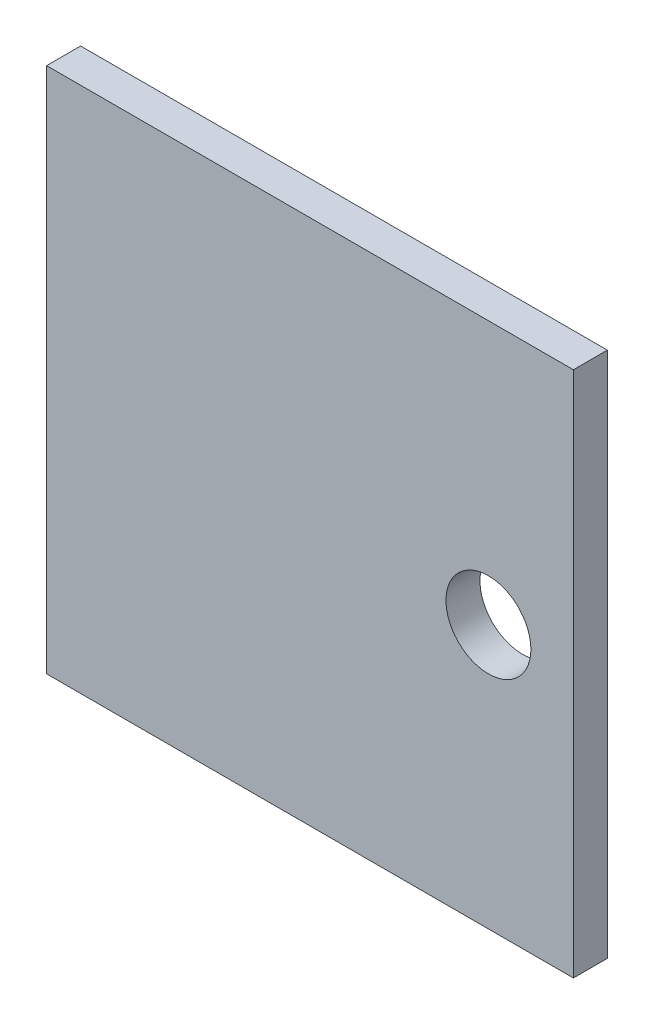
ISO-10303-21;
HEADER;
FILE_DESCRIPTION(('STEP AP214'),'2;1');
FILE_NAME('part.step','',(''),(''),'','','');
FILE_SCHEMA(('AUTOMOTIVE_DESIGN { 1 0 10303 214 1 1 1 1 }'));
ENDSEC;
DATA;
#1=APPLICATION_CONTEXT('core data for automotive mechanical design processes');
#2=APPLICATION_PROTOCOL_DEFINITION('international standard','automotive_design',2000,#1);
#3=PRODUCT_CONTEXT('',#1,'mechanical');
#4=PRODUCT('Part','Part','',(#3));
#5=PRODUCT_RELATED_PRODUCT_CATEGORY('part','',(#4));
#6=PRODUCT_DEFINITION_FORMATION('','',#4);
#7=PRODUCT_DEFINITION_CONTEXT('part definition',#1,'design');
#8=PRODUCT_DEFINITION('design','',#6,#7);
#9=PRODUCT_DEFINITION_SHAPE('','',#8);
#10=(LENGTH_UNIT() NAMED_UNIT(*) SI_UNIT(.MILLI.,.METRE.));
#11=(NAMED_UNIT(*) PLANE_ANGLE_UNIT() SI_UNIT($,.RADIAN.));
#12=(NAMED_UNIT(*) SI_UNIT($,.STERADIAN.) SOLID_ANGLE_UNIT());
#13=UNCERTAINTY_MEASURE_WITH_UNIT(LENGTH_MEASURE(1.E-05),#10,'distance_accuracy_value','');
#14=(GEOMETRIC_REPRESENTATION_CONTEXT(3) GLOBAL_UNCERTAINTY_ASSIGNED_CONTEXT((#13)) GLOBAL_UNIT_ASSIGNED_CONTEXT((#10,
#11,#12)) REPRESENTATION_CONTEXT('',''));
#15=CARTESIAN_POINT('',(0.,0.,0.));
#16=DIRECTION('',(0.,0.,1.));
#17=DIRECTION('',(1.,0.,0.));
#18=AXIS2_PLACEMENT_3D('',#15,#16,#17);
#19=CARTESIAN_POINT('',(0.,0.,4.));
#20=DIRECTION('',(0.,0.,1.));
#21=DIRECTION('',(1.,0.,0.));
#22=AXIS2_PLACEMENT_3D('',#19,#20,#21);
#23=PLANE('',#22);
#24=DIRECTION('',(0.,1.,0.));
#25=VECTOR('',#24,1.);
#26=CARTESIAN_POINT('',(31.,31.,4.));
#27=LINE('',#26,#25);
#28=CARTESIAN_POINT('',(31.,-31.,4.));
#29=VERTEX_POINT('',#28);
#30=CARTESIAN_POINT('',(31.,31.,4.));
#31=VERTEX_POINT('',#30);
#32=EDGE_CURVE('E87',#29,#31,#27,.T.);
#33=ORIENTED_EDGE('',*,*,#32,.T.);
#34=DIRECTION('',(-1.,0.,0.));
#35=VECTOR('',#34,1.);
#36=CARTESIAN_POINT('',(-31.,31.,4.));
#37=LINE('',#36,#35);
#38=CARTESIAN_POINT('',(-31.,31.,4.));
#39=VERTEX_POINT('',#38);
#40=EDGE_CURVE('E82',#31,#39,#37,.T.);
#41=ORIENTED_EDGE('',*,*,#40,.T.);
#42=DIRECTION('',(0.,-1.,0.));
#43=VECTOR('',#42,1.);
#44=CARTESIAN_POINT('',(-31.,31.,4.));
#45=LINE('',#44,#43);
#46=CARTESIAN_POINT('',(-31.,-31.,4.));
#47=VERTEX_POINT('',#46);
#48=EDGE_CURVE('E85',#39,#47,#45,.T.);
#49=ORIENTED_EDGE('',*,*,#48,.T.);
#50=DIRECTION('',(1.,0.,0.));
#51=VECTOR('',#50,1.);
#52=CARTESIAN_POINT('',(-31.,-31.,4.));
#53=LINE('',#52,#51);
#54=EDGE_CURVE('E52',#47,#29,#53,.T.);
#55=ORIENTED_EDGE('',*,*,#54,.T.);
#56=EDGE_LOOP('',(#33,#41,#49,#55));
#57=FACE_BOUND('',#56,.T.);
#58=CARTESIAN_POINT('',(21.,0.,4.));
#59=DIRECTION('',(0.,0.,1.));
#60=DIRECTION('',(1.,0.,0.));
#61=AXIS2_PLACEMENT_3D('',#58,#59,#60);
#62=CIRCLE('',#61,5.);
#63=CARTESIAN_POINT('',(26.,0.,4.));
#64=VERTEX_POINT('',#63);
#65=EDGE_CURVE('E102',#64,#64,#62,.T.);
#66=ORIENTED_EDGE('',*,*,#65,.F.);
#67=EDGE_LOOP('',(#66));
#68=FACE_BOUND('',#67,.T.);
#69=ADVANCED_FACE('F35',(#57,#68),#23,.T.);
#70=CARTESIAN_POINT('',(0.,0.,0.));
#71=DIRECTION('',(0.,0.,1.));
#72=DIRECTION('',(1.,0.,0.));
#73=AXIS2_PLACEMENT_3D('',#70,#71,#72);
#74=PLANE('',#73);
#75=DIRECTION('',(0.,1.,0.));
#76=VECTOR('',#75,1.);
#77=CARTESIAN_POINT('',(31.,31.,0.));
#78=LINE('',#77,#76);
#79=CARTESIAN_POINT('',(31.,-31.,0.));
#80=VERTEX_POINT('',#79);
#81=CARTESIAN_POINT('',(31.,31.,0.));
#82=VERTEX_POINT('',#81);
#83=EDGE_CURVE('E99',#80,#82,#78,.T.);
#84=ORIENTED_EDGE('',*,*,#83,.F.);
#85=DIRECTION('',(1.,0.,0.));
#86=VECTOR('',#85,1.);
#87=CARTESIAN_POINT('',(-31.,-31.,0.));
#88=LINE('',#87,#86);
#89=CARTESIAN_POINT('',(-31.,-31.,0.));
#90=VERTEX_POINT('',#89);
#91=EDGE_CURVE('E75',#90,#80,#88,.T.);
#92=ORIENTED_EDGE('',*,*,#91,.F.);
#93=DIRECTION('',(0.,-1.,0.));
#94=VECTOR('',#93,1.);
#95=CARTESIAN_POINT('',(-31.,31.,0.));
#96=LINE('',#95,#94);
#97=CARTESIAN_POINT('',(-31.,31.,0.));
#98=VERTEX_POINT('',#97);
#99=EDGE_CURVE('E69',#98,#90,#96,.T.);
#100=ORIENTED_EDGE('',*,*,#99,.F.);
#101=DIRECTION('',(-1.,0.,0.));
#102=VECTOR('',#101,1.);
#103=CARTESIAN_POINT('',(-31.,31.,0.));
#104=LINE('',#103,#102);
#105=EDGE_CURVE('E91',#82,#98,#104,.T.);
#106=ORIENTED_EDGE('',*,*,#105,.F.);
#107=EDGE_LOOP('',(#84,#92,#100,#106));
#108=FACE_BOUND('',#107,.T.);
#109=CARTESIAN_POINT('',(21.,0.,0.));
#110=DIRECTION('',(0.,0.,1.));
#111=DIRECTION('',(1.,0.,0.));
#112=AXIS2_PLACEMENT_3D('',#109,#110,#111);
#113=CIRCLE('',#112,5.);
#114=CARTESIAN_POINT('',(26.,0.,0.));
#115=VERTEX_POINT('',#114);
#116=EDGE_CURVE('E114',#115,#115,#113,.T.);
#117=ORIENTED_EDGE('',*,*,#116,.T.);
#118=EDGE_LOOP('',(#117));
#119=FACE_BOUND('',#118,.T.);
#120=ADVANCED_FACE('F110',(#108,#119),#74,.F.);
#121=CARTESIAN_POINT('',(31.,31.,4.));
#122=DIRECTION('',(-1.,0.,0.));
#123=DIRECTION('',(0.,-1.,0.));
#124=AXIS2_PLACEMENT_3D('',#121,#122,#123);
#125=PLANE('',#124);
#126=ORIENTED_EDGE('',*,*,#83,.T.);
#127=DIRECTION('',(0.,0.,-1.));
#128=VECTOR('',#127,1.);
#129=CARTESIAN_POINT('',(31.,31.,4.));
#130=LINE('',#129,#128);
#131=EDGE_CURVE('E11',#31,#82,#130,.T.);
#132=ORIENTED_EDGE('',*,*,#131,.F.);
#133=ORIENTED_EDGE('',*,*,#32,.F.);
#134=DIRECTION('',(0.,0.,-1.));
#135=VECTOR('',#134,1.);
#136=CARTESIAN_POINT('',(31.,-31.,4.));
#137=LINE('',#136,#135);
#138=EDGE_CURVE('E95',#29,#80,#137,.T.);
#139=ORIENTED_EDGE('',*,*,#138,.T.);
#140=EDGE_LOOP('',(#126,#132,#133,#139));
#141=FACE_BOUND('',#140,.T.);
#142=ADVANCED_FACE('F37',(#141),#125,.F.);
#143=CARTESIAN_POINT('',(-31.,31.,4.));
#144=DIRECTION('',(0.,-1.,0.));
#145=DIRECTION('',(0.,0.,-1.));
#146=AXIS2_PLACEMENT_3D('',#143,#144,#145);
#147=PLANE('',#146);
#148=ORIENTED_EDGE('',*,*,#105,.T.);
#149=DIRECTION('',(0.,0.,-1.));
#150=VECTOR('',#149,1.);
#151=CARTESIAN_POINT('',(-31.,31.,4.));
#152=LINE('',#151,#150);
#153=EDGE_CURVE('E44',#39,#98,#152,.T.);
#154=ORIENTED_EDGE('',*,*,#153,.F.);
#155=ORIENTED_EDGE('',*,*,#40,.F.);
#156=ORIENTED_EDGE('',*,*,#131,.T.);
#157=EDGE_LOOP('',(#148,#154,#155,#156));
#158=FACE_BOUND('',#157,.T.);
#159=ADVANCED_FACE('F90',(#158),#147,.F.);
#160=CARTESIAN_POINT('',(-31.,31.,4.));
#161=DIRECTION('',(1.,0.,0.));
#162=DIRECTION('',(0.,1.,0.));
#163=AXIS2_PLACEMENT_3D('',#160,#161,#162);
#164=PLANE('',#163);
#165=ORIENTED_EDGE('',*,*,#99,.T.);
#166=DIRECTION('',(0.,0.,-1.));
#167=VECTOR('',#166,1.);
#168=CARTESIAN_POINT('',(-31.,-31.,4.));
#169=LINE('',#168,#167);
#170=EDGE_CURVE('E92',#47,#90,#169,.T.);
#171=ORIENTED_EDGE('',*,*,#170,.F.);
#172=ORIENTED_EDGE('',*,*,#48,.F.);
#173=ORIENTED_EDGE('',*,*,#153,.T.);
#174=EDGE_LOOP('',(#165,#171,#172,#173));
#175=FACE_BOUND('',#174,.T.);
#176=ADVANCED_FACE('F93',(#175),#164,.F.);
#177=CARTESIAN_POINT('',(-31.,-31.,4.));
#178=DIRECTION('',(0.,1.,0.));
#179=DIRECTION('',(0.,0.,1.));
#180=AXIS2_PLACEMENT_3D('',#177,#178,#179);
#181=PLANE('',#180);
#182=ORIENTED_EDGE('',*,*,#91,.T.);
#183=ORIENTED_EDGE('',*,*,#138,.F.);
#184=ORIENTED_EDGE('',*,*,#54,.F.);
#185=ORIENTED_EDGE('',*,*,#170,.T.);
#186=EDGE_LOOP('',(#182,#183,#184,#185));
#187=FACE_BOUND('',#186,.T.);
#188=ADVANCED_FACE('F107',(#187),#181,.F.);
#189=CARTESIAN_POINT('',(21.,0.,4.));
#190=DIRECTION('',(0.,0.,-1.));
#191=DIRECTION('',(-1.,0.,0.));
#192=AXIS2_PLACEMENT_3D('',#189,#190,#191);
#193=CYLINDRICAL_SURFACE('',#192,5.);
#194=ORIENTED_EDGE('',*,*,#65,.T.);
#195=EDGE_LOOP('',(#194));
#196=FACE_BOUND('',#195,.T.);
#197=ORIENTED_EDGE('',*,*,#116,.F.);
#198=EDGE_LOOP('',(#197));
#199=FACE_BOUND('',#198,.T.);
#200=ADVANCED_FACE('F120',(#196,#199),#193,.F.);
#201=CLOSED_SHELL('',(#69,#120,#142,#159,#176,#188,#200));
#202=MANIFOLD_SOLID_BREP('B2',#201);
#203=ADVANCED_BREP_SHAPE_REPRESENTATION('',(#18,#202),#14);
#204=SHAPE_DEFINITION_REPRESENTATION(#9,#203);
ENDSEC;
END-ISO-10303-21;
